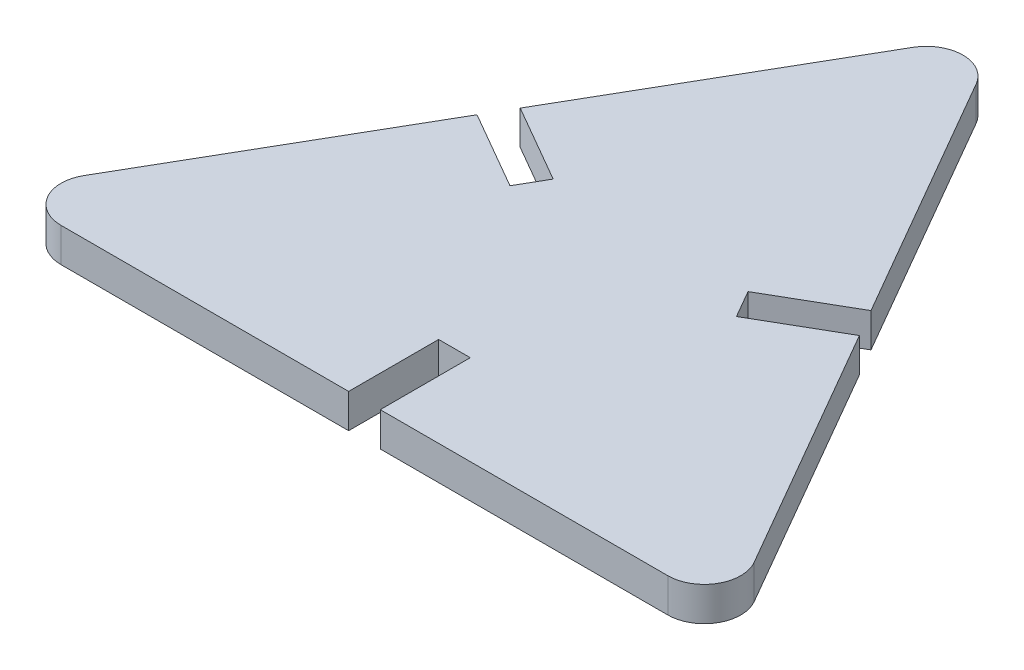
ISO-10303-21;
HEADER;
FILE_DESCRIPTION(('STEP AP214'),'2;1');
FILE_NAME('part.step','',(''),(''),'','','');
FILE_SCHEMA(('AUTOMOTIVE_DESIGN { 1 0 10303 214 1 1 1 1 }'));
ENDSEC;
DATA;
#1=APPLICATION_CONTEXT('core data for automotive mechanical design processes');
#2=APPLICATION_PROTOCOL_DEFINITION('international standard','automotive_design',2000,#1);
#3=PRODUCT_CONTEXT('',#1,'mechanical');
#4=PRODUCT('Part','Part','',(#3));
#5=PRODUCT_RELATED_PRODUCT_CATEGORY('part','',(#4));
#6=PRODUCT_DEFINITION_FORMATION('','',#4);
#7=PRODUCT_DEFINITION_CONTEXT('part definition',#1,'design');
#8=PRODUCT_DEFINITION('design','',#6,#7);
#9=PRODUCT_DEFINITION_SHAPE('','',#8);
#10=(LENGTH_UNIT() NAMED_UNIT(*) SI_UNIT(.MILLI.,.METRE.));
#11=(NAMED_UNIT(*) PLANE_ANGLE_UNIT() SI_UNIT($,.RADIAN.));
#12=(NAMED_UNIT(*) SI_UNIT($,.STERADIAN.) SOLID_ANGLE_UNIT());
#13=UNCERTAINTY_MEASURE_WITH_UNIT(LENGTH_MEASURE(1.E-05),#10,'distance_accuracy_value','');
#14=(GEOMETRIC_REPRESENTATION_CONTEXT(3) GLOBAL_UNCERTAINTY_ASSIGNED_CONTEXT((#13)) GLOBAL_UNIT_ASSIGNED_CONTEXT((#10,
#11,#12)) REPRESENTATION_CONTEXT('',''));
#15=CARTESIAN_POINT('',(0.,0.,0.));
#16=DIRECTION('',(0.,0.,1.));
#17=DIRECTION('',(1.,0.,0.));
#18=AXIS2_PLACEMENT_3D('',#15,#16,#17);
#19=CARTESIAN_POINT('',(-1.3,2.8,17.4));
#20=DIRECTION('',(-1.,0.,0.));
#21=DIRECTION('',(0.,0.,1.));
#22=AXIS2_PLACEMENT_3D('',#19,#20,#21);
#23=PLANE('',#22);
#24=DIRECTION('',(0.,0.,-1.));
#25=VECTOR('',#24,1.);
#26=CARTESIAN_POINT('',(-1.3,0.,17.4));
#27=LINE('',#26,#25);
#28=CARTESIAN_POINT('',(-1.3,0.,17.4));
#29=VERTEX_POINT('',#28);
#30=CARTESIAN_POINT('',(-1.3,0.,10.));
#31=VERTEX_POINT('',#30);
#32=EDGE_CURVE('E188',#29,#31,#27,.T.);
#33=ORIENTED_EDGE('',*,*,#32,.T.);
#34=DIRECTION('',(0.,-1.,0.));
#35=VECTOR('',#34,1.);
#36=CARTESIAN_POINT('',(-1.3,2.8,10.));
#37=LINE('',#36,#35);
#38=CARTESIAN_POINT('',(-1.3,2.8,10.));
#39=VERTEX_POINT('',#38);
#40=EDGE_CURVE('E11',#39,#31,#37,.T.);
#41=ORIENTED_EDGE('',*,*,#40,.F.);
#42=DIRECTION('',(0.,0.,-1.));
#43=VECTOR('',#42,1.);
#44=CARTESIAN_POINT('',(-1.3,2.8,17.4));
#45=LINE('',#44,#43);
#46=CARTESIAN_POINT('',(-1.3,2.8,17.4));
#47=VERTEX_POINT('',#46);
#48=EDGE_CURVE('E222',#47,#39,#45,.T.);
#49=ORIENTED_EDGE('',*,*,#48,.F.);
#50=DIRECTION('',(0.,-1.,0.));
#51=VECTOR('',#50,1.);
#52=CARTESIAN_POINT('',(-1.3,2.8,17.4));
#53=LINE('',#52,#51);
#54=EDGE_CURVE('E184',#47,#29,#53,.T.);
#55=ORIENTED_EDGE('',*,*,#54,.T.);
#56=EDGE_LOOP('',(#33,#41,#49,#55));
#57=FACE_BOUND('',#56,.T.);
#58=ADVANCED_FACE('F32',(#57),#23,.F.);
#59=CARTESIAN_POINT('',(-1.3,2.8,10.));
#60=DIRECTION('',(0.,0.,-1.));
#61=DIRECTION('',(-1.,0.,0.));
#62=AXIS2_PLACEMENT_3D('',#59,#60,#61);
#63=PLANE('',#62);
#64=DIRECTION('',(1.,0.,0.));
#65=VECTOR('',#64,1.);
#66=CARTESIAN_POINT('',(-1.3,0.,10.));
#67=LINE('',#66,#65);
#68=CARTESIAN_POINT('',(1.3,0.,10.));
#69=VERTEX_POINT('',#68);
#70=EDGE_CURVE('E191',#31,#69,#67,.T.);
#71=ORIENTED_EDGE('',*,*,#70,.T.);
#72=DIRECTION('',(0.,-1.,0.));
#73=VECTOR('',#72,1.);
#74=CARTESIAN_POINT('',(1.3,2.8,10.));
#75=LINE('',#74,#73);
#76=CARTESIAN_POINT('',(1.3,2.8,10.));
#77=VERTEX_POINT('',#76);
#78=EDGE_CURVE('E40',#77,#69,#75,.T.);
#79=ORIENTED_EDGE('',*,*,#78,.F.);
#80=DIRECTION('',(1.,0.,0.));
#81=VECTOR('',#80,1.);
#82=CARTESIAN_POINT('',(-1.3,2.8,10.));
#83=LINE('',#82,#81);
#84=EDGE_CURVE('E121',#39,#77,#83,.T.);
#85=ORIENTED_EDGE('',*,*,#84,.F.);
#86=ORIENTED_EDGE('',*,*,#40,.T.);
#87=EDGE_LOOP('',(#71,#79,#85,#86));
#88=FACE_BOUND('',#87,.T.);
#89=ADVANCED_FACE('F330',(#88),#63,.F.);
#90=CARTESIAN_POINT('',(1.3,2.8,17.4));
#91=DIRECTION('',(1.,0.,0.));
#92=DIRECTION('',(0.,0.,-1.));
#93=AXIS2_PLACEMENT_3D('',#90,#91,#92);
#94=PLANE('',#93);
#95=DIRECTION('',(0.,0.,1.));
#96=VECTOR('',#95,1.);
#97=CARTESIAN_POINT('',(1.3,0.,17.4));
#98=LINE('',#97,#96);
#99=CARTESIAN_POINT('',(1.3,0.,17.4));
#100=VERTEX_POINT('',#99);
#101=EDGE_CURVE('E193',#69,#100,#98,.T.);
#102=ORIENTED_EDGE('',*,*,#101,.T.);
#103=DIRECTION('',(0.,-1.,0.));
#104=VECTOR('',#103,1.);
#105=CARTESIAN_POINT('',(1.3,2.8,17.4));
#106=LINE('',#105,#104);
#107=CARTESIAN_POINT('',(1.3,2.8,17.4));
#108=VERTEX_POINT('',#107);
#109=EDGE_CURVE('E259',#108,#100,#106,.T.);
#110=ORIENTED_EDGE('',*,*,#109,.F.);
#111=DIRECTION('',(0.,0.,1.));
#112=VECTOR('',#111,1.);
#113=CARTESIAN_POINT('',(1.3,2.8,17.4));
#114=LINE('',#113,#112);
#115=EDGE_CURVE('E267',#77,#108,#114,.T.);
#116=ORIENTED_EDGE('',*,*,#115,.F.);
#117=ORIENTED_EDGE('',*,*,#78,.T.);
#118=EDGE_LOOP('',(#102,#110,#116,#117));
#119=FACE_BOUND('',#118,.T.);
#120=ADVANCED_FACE('F265',(#119),#94,.F.);
#121=CARTESIAN_POINT('',(1.3,2.8,17.4));
#122=DIRECTION('',(0.,0.,-1.));
#123=DIRECTION('',(-1.,0.,0.));
#124=AXIS2_PLACEMENT_3D('',#121,#122,#123);
#125=PLANE('',#124);
#126=DIRECTION('',(1.,0.,0.));
#127=VECTOR('',#126,1.);
#128=CARTESIAN_POINT('',(1.3,0.,17.4));
#129=LINE('',#128,#127);
#130=CARTESIAN_POINT('',(24.9415316289919,0.,17.4));
#131=VERTEX_POINT('',#130);
#132=EDGE_CURVE('E195',#100,#131,#129,.T.);
#133=ORIENTED_EDGE('',*,*,#132,.T.);
#134=DIRECTION('',(0.,-1.,0.));
#135=VECTOR('',#134,1.);
#136=CARTESIAN_POINT('',(24.9415316289919,2.8,17.4));
#137=LINE('',#136,#135);
#138=CARTESIAN_POINT('',(24.9415316289919,2.8,17.4));
#139=VERTEX_POINT('',#138);
#140=EDGE_CURVE('E256',#139,#131,#137,.T.);
#141=ORIENTED_EDGE('',*,*,#140,.F.);
#142=DIRECTION('',(1.,0.,0.));
#143=VECTOR('',#142,1.);
#144=CARTESIAN_POINT('',(1.3,2.8,17.4));
#145=LINE('',#144,#143);
#146=EDGE_CURVE('E285',#108,#139,#145,.T.);
#147=ORIENTED_EDGE('',*,*,#146,.F.);
#148=ORIENTED_EDGE('',*,*,#109,.T.);
#149=EDGE_LOOP('',(#133,#141,#147,#148));
#150=FACE_BOUND('',#149,.T.);
#151=ADVANCED_FACE('F276',(#150),#125,.F.);
#152=CARTESIAN_POINT('',(24.9415316289919,2.8,14.4));
#153=DIRECTION('',(0.,-1.,0.));
#154=DIRECTION('',(0.,0.,-1.));
#155=AXIS2_PLACEMENT_3D('',#152,#153,#154);
#156=CYLINDRICAL_SURFACE('',#155,3.);
#157=CARTESIAN_POINT('',(24.9415316289919,0.,14.4));
#158=DIRECTION('',(0.,1.,0.));
#159=DIRECTION('',(0.,0.,1.));
#160=AXIS2_PLACEMENT_3D('',#157,#158,#159);
#161=CIRCLE('',#160,3.);
#162=CARTESIAN_POINT('',(27.5396078403452,0.,12.9));
#163=VERTEX_POINT('',#162);
#164=EDGE_CURVE('E197',#131,#163,#161,.T.);
#165=ORIENTED_EDGE('',*,*,#164,.T.);
#166=DIRECTION('',(0.,-1.,0.));
#167=VECTOR('',#166,1.);
#168=CARTESIAN_POINT('',(27.5396078403452,2.8,12.9));
#169=LINE('',#168,#167);
#170=CARTESIAN_POINT('',(27.5396078403452,2.8,12.9));
#171=VERTEX_POINT('',#170);
#172=EDGE_CURVE('E253',#171,#163,#169,.T.);
#173=ORIENTED_EDGE('',*,*,#172,.F.);
#174=CARTESIAN_POINT('',(24.9415316289919,2.8,14.4));
#175=DIRECTION('',(0.,1.,0.));
#176=DIRECTION('',(0.,0.,1.));
#177=AXIS2_PLACEMENT_3D('',#174,#175,#176);
#178=CIRCLE('',#177,3.);
#179=EDGE_CURVE('E282',#139,#171,#178,.T.);
#180=ORIENTED_EDGE('',*,*,#179,.F.);
#181=ORIENTED_EDGE('',*,*,#140,.T.);
#182=EDGE_LOOP('',(#165,#173,#180,#181));
#183=FACE_BOUND('',#182,.T.);
#184=ADVANCED_FACE('F280',(#183),#156,.T.);
#185=CARTESIAN_POINT('',(27.5396078403452,2.8,12.9));
#186=DIRECTION('',(-0.866025403784439,0.,0.5));
#187=DIRECTION('',(0.5,0.,0.866025403784439));
#188=AXIS2_PLACEMENT_3D('',#185,#186,#187);
#189=PLANE('',#188);
#190=DIRECTION('',(-0.5,0.,-0.866025403784439));
#191=VECTOR('',#190,1.);
#192=CARTESIAN_POINT('',(27.5396078403452,0.,12.9));
#193=LINE('',#192,#191);
#194=CARTESIAN_POINT('',(15.7188420258493,0.,-7.57416697508027));
#195=VERTEX_POINT('',#194);
#196=EDGE_CURVE('E199',#163,#195,#193,.T.);
#197=ORIENTED_EDGE('',*,*,#196,.T.);
#198=DIRECTION('',(0.,-1.,0.));
#199=VECTOR('',#198,1.);
#200=CARTESIAN_POINT('',(15.7188420258493,2.8,-7.57416697508027));
#201=LINE('',#200,#199);
#202=CARTESIAN_POINT('',(15.7188420258493,2.8,-7.57416697508027));
#203=VERTEX_POINT('',#202);
#204=EDGE_CURVE('E250',#203,#195,#201,.T.);
#205=ORIENTED_EDGE('',*,*,#204,.F.);
#206=DIRECTION('',(-0.5,0.,-0.866025403784439));
#207=VECTOR('',#206,1.);
#208=CARTESIAN_POINT('',(27.5396078403452,2.8,12.9));
#209=LINE('',#208,#207);
#210=EDGE_CURVE('E284',#171,#203,#209,.T.);
#211=ORIENTED_EDGE('',*,*,#210,.F.);
#212=ORIENTED_EDGE('',*,*,#172,.T.);
#213=EDGE_LOOP('',(#197,#205,#211,#212));
#214=FACE_BOUND('',#213,.T.);
#215=ADVANCED_FACE('F343',(#214),#189,.F.);
#216=CARTESIAN_POINT('',(15.7188420258493,2.8,-7.57416697508027));
#217=DIRECTION('',(0.5,0.,0.866025403784438));
#218=DIRECTION('',(0.866025403784438,0.,-0.5));
#219=AXIS2_PLACEMENT_3D('',#216,#217,#218);
#220=PLANE('',#219);
#221=DIRECTION('',(-0.866025403784438,0.,0.5));
#222=VECTOR('',#221,1.);
#223=CARTESIAN_POINT('',(15.7188420258493,0.,-7.57416697508027));
#224=LINE('',#223,#222);
#225=CARTESIAN_POINT('',(9.31025403784441,0.,-3.87416697508027));
#226=VERTEX_POINT('',#225);
#227=EDGE_CURVE('E201',#195,#226,#224,.T.);
#228=ORIENTED_EDGE('',*,*,#227,.T.);
#229=DIRECTION('',(0.,-1.,0.));
#230=VECTOR('',#229,1.);
#231=CARTESIAN_POINT('',(9.31025403784441,2.8,-3.87416697508027));
#232=LINE('',#231,#230);
#233=CARTESIAN_POINT('',(9.31025403784441,2.8,-3.87416697508027));
#234=VERTEX_POINT('',#233);
#235=EDGE_CURVE('E247',#234,#226,#232,.T.);
#236=ORIENTED_EDGE('',*,*,#235,.F.);
#237=DIRECTION('',(-0.866025403784438,0.,0.5));
#238=VECTOR('',#237,1.);
#239=CARTESIAN_POINT('',(15.7188420258493,2.8,-7.57416697508027));
#240=LINE('',#239,#238);
#241=EDGE_CURVE('E287',#203,#234,#240,.T.);
#242=ORIENTED_EDGE('',*,*,#241,.F.);
#243=ORIENTED_EDGE('',*,*,#204,.T.);
#244=EDGE_LOOP('',(#228,#236,#242,#243));
#245=FACE_BOUND('',#244,.T.);
#246=ADVANCED_FACE('F346',(#245),#220,.F.);
#247=CARTESIAN_POINT('',(9.31025403784441,2.8,-3.87416697508027));
#248=DIRECTION('',(-0.866025403784438,0.,0.5));
#249=DIRECTION('',(0.5,0.,0.866025403784439));
#250=AXIS2_PLACEMENT_3D('',#247,#248,#249);
#251=PLANE('',#250);
#252=DIRECTION('',(-0.5,0.,-0.866025403784438));
#253=VECTOR('',#252,1.);
#254=CARTESIAN_POINT('',(9.31025403784441,0.,-3.87416697508027));
#255=LINE('',#254,#253);
#256=CARTESIAN_POINT('',(8.01025403784441,0.,-6.12583302491981));
#257=VERTEX_POINT('',#256);
#258=EDGE_CURVE('E203',#226,#257,#255,.T.);
#259=ORIENTED_EDGE('',*,*,#258,.T.);
#260=DIRECTION('',(0.,-1.,0.));
#261=VECTOR('',#260,1.);
#262=CARTESIAN_POINT('',(8.01025403784441,2.8,-6.12583302491981));
#263=LINE('',#262,#261);
#264=CARTESIAN_POINT('',(8.01025403784441,2.8,-6.12583302491981));
#265=VERTEX_POINT('',#264);
#266=EDGE_CURVE('E244',#265,#257,#263,.T.);
#267=ORIENTED_EDGE('',*,*,#266,.F.);
#268=DIRECTION('',(-0.5,0.,-0.866025403784438));
#269=VECTOR('',#268,1.);
#270=CARTESIAN_POINT('',(9.31025403784441,2.8,-3.87416697508027));
#271=LINE('',#270,#269);
#272=EDGE_CURVE('E293',#234,#265,#271,.T.);
#273=ORIENTED_EDGE('',*,*,#272,.F.);
#274=ORIENTED_EDGE('',*,*,#235,.T.);
#275=EDGE_LOOP('',(#259,#267,#273,#274));
#276=FACE_BOUND('',#275,.T.);
#277=ADVANCED_FACE('F350',(#276),#251,.F.);
#278=CARTESIAN_POINT('',(14.4188420258492,2.8,-9.82583302491981));
#279=DIRECTION('',(-0.5,0.,-0.866025403784438));
#280=DIRECTION('',(-0.866025403784438,0.,0.5));
#281=AXIS2_PLACEMENT_3D('',#278,#279,#280);
#282=PLANE('',#281);
#283=DIRECTION('',(0.866025403784438,0.,-0.5));
#284=VECTOR('',#283,1.);
#285=CARTESIAN_POINT('',(14.4188420258492,0.,-9.82583302491981));
#286=LINE('',#285,#284);
#287=CARTESIAN_POINT('',(14.4188420258492,0.,-9.82583302491981));
#288=VERTEX_POINT('',#287);
#289=EDGE_CURVE('E205',#257,#288,#286,.T.);
#290=ORIENTED_EDGE('',*,*,#289,.T.);
#291=DIRECTION('',(0.,-1.,0.));
#292=VECTOR('',#291,1.);
#293=CARTESIAN_POINT('',(14.4188420258492,2.8,-9.82583302491981));
#294=LINE('',#293,#292);
#295=CARTESIAN_POINT('',(14.4188420258492,2.8,-9.82583302491981));
#296=VERTEX_POINT('',#295);
#297=EDGE_CURVE('E241',#296,#288,#294,.T.);
#298=ORIENTED_EDGE('',*,*,#297,.F.);
#299=DIRECTION('',(0.866025403784438,0.,-0.5));
#300=VECTOR('',#299,1.);
#301=CARTESIAN_POINT('',(14.4188420258492,2.8,-9.82583302491981));
#302=LINE('',#301,#300);
#303=EDGE_CURVE('E295',#265,#296,#302,.T.);
#304=ORIENTED_EDGE('',*,*,#303,.F.);
#305=ORIENTED_EDGE('',*,*,#266,.T.);
#306=EDGE_LOOP('',(#290,#298,#304,#305));
#307=FACE_BOUND('',#306,.T.);
#308=ADVANCED_FACE('F354',(#307),#282,.F.);
#309=CARTESIAN_POINT('',(14.4188420258492,2.8,-9.82583302491981));
#310=DIRECTION('',(-0.866025403784438,0.,0.500000000000001));
#311=DIRECTION('',(0.500000000000001,0.,0.866025403784438));
#312=AXIS2_PLACEMENT_3D('',#309,#310,#311);
#313=PLANE('',#312);
#314=DIRECTION('',(-0.500000000000001,0.,-0.866025403784438));
#315=VECTOR('',#314,1.);
#316=CARTESIAN_POINT('',(14.4188420258492,0.,-9.82583302491981));
#317=LINE('',#316,#315);
#318=CARTESIAN_POINT('',(2.59807621135331,0.,-30.3));
#319=VERTEX_POINT('',#318);
#320=EDGE_CURVE('E207',#288,#319,#317,.T.);
#321=ORIENTED_EDGE('',*,*,#320,.T.);
#322=DIRECTION('',(0.,-1.,0.));
#323=VECTOR('',#322,1.);
#324=CARTESIAN_POINT('',(2.59807621135331,2.8,-30.3));
#325=LINE('',#324,#323);
#326=CARTESIAN_POINT('',(2.59807621135331,2.8,-30.3));
#327=VERTEX_POINT('',#326);
#328=EDGE_CURVE('E238',#327,#319,#325,.T.);
#329=ORIENTED_EDGE('',*,*,#328,.F.);
#330=DIRECTION('',(-0.500000000000001,0.,-0.866025403784438));
#331=VECTOR('',#330,1.);
#332=CARTESIAN_POINT('',(14.4188420258492,2.8,-9.82583302491981));
#333=LINE('',#332,#331);
#334=EDGE_CURVE('E297',#296,#327,#333,.T.);
#335=ORIENTED_EDGE('',*,*,#334,.F.);
#336=ORIENTED_EDGE('',*,*,#297,.T.);
#337=EDGE_LOOP('',(#321,#329,#335,#336));
#338=FACE_BOUND('',#337,.T.);
#339=ADVANCED_FACE('F358',(#338),#313,.F.);
#340=CARTESIAN_POINT('',(0.,2.8,-28.8));
#341=DIRECTION('',(0.,-1.,0.));
#342=DIRECTION('',(0.,0.,-1.));
#343=AXIS2_PLACEMENT_3D('',#340,#341,#342);
#344=CYLINDRICAL_SURFACE('',#343,3.);
#345=CARTESIAN_POINT('',(0.,0.,-28.8));
#346=DIRECTION('',(0.,1.,0.));
#347=DIRECTION('',(0.,0.,1.));
#348=AXIS2_PLACEMENT_3D('',#345,#346,#347);
#349=CIRCLE('',#348,3.);
#350=CARTESIAN_POINT('',(-2.59807621135332,0.,-30.3));
#351=VERTEX_POINT('',#350);
#352=EDGE_CURVE('E209',#319,#351,#349,.T.);
#353=ORIENTED_EDGE('',*,*,#352,.T.);
#354=DIRECTION('',(0.,-1.,0.));
#355=VECTOR('',#354,1.);
#356=CARTESIAN_POINT('',(-2.59807621135332,2.8,-30.3));
#357=LINE('',#356,#355);
#358=CARTESIAN_POINT('',(-2.59807621135332,2.8,-30.3));
#359=VERTEX_POINT('',#358);
#360=EDGE_CURVE('E235',#359,#351,#357,.T.);
#361=ORIENTED_EDGE('',*,*,#360,.F.);
#362=CARTESIAN_POINT('',(0.,2.8,-28.8));
#363=DIRECTION('',(0.,1.,0.));
#364=DIRECTION('',(0.,0.,1.));
#365=AXIS2_PLACEMENT_3D('',#362,#363,#364);
#366=CIRCLE('',#365,3.);
#367=EDGE_CURVE('E299',#327,#359,#366,.T.);
#368=ORIENTED_EDGE('',*,*,#367,.F.);
#369=ORIENTED_EDGE('',*,*,#328,.T.);
#370=EDGE_LOOP('',(#353,#361,#368,#369));
#371=FACE_BOUND('',#370,.T.);
#372=ADVANCED_FACE('F362',(#371),#344,.T.);
#373=CARTESIAN_POINT('',(-2.59807621135332,2.8,-30.3));
#374=DIRECTION('',(0.866025403784438,0.,0.5));
#375=DIRECTION('',(0.5,0.,-0.866025403784438));
#376=AXIS2_PLACEMENT_3D('',#373,#374,#375);
#377=PLANE('',#376);
#378=DIRECTION('',(-0.5,0.,0.866025403784438));
#379=VECTOR('',#378,1.);
#380=CARTESIAN_POINT('',(-2.59807621135332,0.,-30.3));
#381=LINE('',#380,#379);
#382=CARTESIAN_POINT('',(-14.4188420258493,0.,-9.8258330249198));
#383=VERTEX_POINT('',#382);
#384=EDGE_CURVE('E211',#351,#383,#381,.T.);
#385=ORIENTED_EDGE('',*,*,#384,.T.);
#386=DIRECTION('',(0.,-1.,0.));
#387=VECTOR('',#386,1.);
#388=CARTESIAN_POINT('',(-14.4188420258493,2.8,-9.8258330249198));
#389=LINE('',#388,#387);
#390=CARTESIAN_POINT('',(-14.4188420258493,2.8,-9.8258330249198));
#391=VERTEX_POINT('',#390);
#392=EDGE_CURVE('E232',#391,#383,#389,.T.);
#393=ORIENTED_EDGE('',*,*,#392,.F.);
#394=DIRECTION('',(-0.5,0.,0.866025403784438));
#395=VECTOR('',#394,1.);
#396=CARTESIAN_POINT('',(-2.59807621135332,2.8,-30.3));
#397=LINE('',#396,#395);
#398=EDGE_CURVE('E301',#359,#391,#397,.T.);
#399=ORIENTED_EDGE('',*,*,#398,.F.);
#400=ORIENTED_EDGE('',*,*,#360,.T.);
#401=EDGE_LOOP('',(#385,#393,#399,#400));
#402=FACE_BOUND('',#401,.T.);
#403=ADVANCED_FACE('F366',(#402),#377,.F.);
#404=CARTESIAN_POINT('',(-14.4188420258493,2.8,-9.8258330249198));
#405=DIRECTION('',(0.5,0.,-0.866025403784439));
#406=DIRECTION('',(-0.866025403784439,0.,-0.5));
#407=AXIS2_PLACEMENT_3D('',#404,#405,#406);
#408=PLANE('',#407);
#409=DIRECTION('',(0.866025403784439,0.,0.5));
#410=VECTOR('',#409,1.);
#411=CARTESIAN_POINT('',(-14.4188420258493,0.,-9.8258330249198));
#412=LINE('',#411,#410);
#413=CARTESIAN_POINT('',(-8.01025403784441,0.,-6.12583302491981));
#414=VERTEX_POINT('',#413);
#415=EDGE_CURVE('E213',#383,#414,#412,.T.);
#416=ORIENTED_EDGE('',*,*,#415,.T.);
#417=DIRECTION('',(0.,-1.,0.));
#418=VECTOR('',#417,1.);
#419=CARTESIAN_POINT('',(-8.01025403784441,2.8,-6.12583302491981));
#420=LINE('',#419,#418);
#421=CARTESIAN_POINT('',(-8.01025403784441,2.8,-6.12583302491981));
#422=VERTEX_POINT('',#421);
#423=EDGE_CURVE('E229',#422,#414,#420,.T.);
#424=ORIENTED_EDGE('',*,*,#423,.F.);
#425=DIRECTION('',(0.866025403784439,0.,0.5));
#426=VECTOR('',#425,1.);
#427=CARTESIAN_POINT('',(-14.4188420258493,2.8,-9.8258330249198));
#428=LINE('',#427,#426);
#429=EDGE_CURVE('E303',#391,#422,#428,.T.);
#430=ORIENTED_EDGE('',*,*,#429,.F.);
#431=ORIENTED_EDGE('',*,*,#392,.T.);
#432=EDGE_LOOP('',(#416,#424,#430,#431));
#433=FACE_BOUND('',#432,.T.);
#434=ADVANCED_FACE('F370',(#433),#408,.F.);
#435=CARTESIAN_POINT('',(-8.01025403784441,2.8,-6.12583302491981));
#436=DIRECTION('',(0.866025403784439,0.,0.5));
#437=DIRECTION('',(0.5,0.,-0.866025403784439));
#438=AXIS2_PLACEMENT_3D('',#435,#436,#437);
#439=PLANE('',#438);
#440=DIRECTION('',(-0.5,0.,0.866025403784439));
#441=VECTOR('',#440,1.);
#442=CARTESIAN_POINT('',(-8.01025403784441,0.,-6.12583302491981));
#443=LINE('',#442,#441);
#444=CARTESIAN_POINT('',(-9.31025403784441,0.,-3.87416697508027));
#445=VERTEX_POINT('',#444);
#446=EDGE_CURVE('E215',#414,#445,#443,.T.);
#447=ORIENTED_EDGE('',*,*,#446,.T.);
#448=DIRECTION('',(0.,-1.,0.));
#449=VECTOR('',#448,1.);
#450=CARTESIAN_POINT('',(-9.31025403784441,2.8,-3.87416697508027));
#451=LINE('',#450,#449);
#452=CARTESIAN_POINT('',(-9.31025403784441,2.8,-3.87416697508027));
#453=VERTEX_POINT('',#452);
#454=EDGE_CURVE('E226',#453,#445,#451,.T.);
#455=ORIENTED_EDGE('',*,*,#454,.F.);
#456=DIRECTION('',(-0.5,0.,0.866025403784439));
#457=VECTOR('',#456,1.);
#458=CARTESIAN_POINT('',(-8.01025403784441,2.8,-6.12583302491981));
#459=LINE('',#458,#457);
#460=EDGE_CURVE('E305',#422,#453,#459,.T.);
#461=ORIENTED_EDGE('',*,*,#460,.F.);
#462=ORIENTED_EDGE('',*,*,#423,.T.);
#463=EDGE_LOOP('',(#447,#455,#461,#462));
#464=FACE_BOUND('',#463,.T.);
#465=ADVANCED_FACE('F311',(#464),#439,.F.);
#466=CARTESIAN_POINT('',(-15.7188420258493,2.8,-7.57416697508026));
#467=DIRECTION('',(-0.5,0.,0.866025403784439));
#468=DIRECTION('',(0.866025403784439,0.,0.5));
#469=AXIS2_PLACEMENT_3D('',#466,#467,#468);
#470=PLANE('',#469);
#471=DIRECTION('',(-0.866025403784439,0.,-0.5));
#472=VECTOR('',#471,1.);
#473=CARTESIAN_POINT('',(-15.7188420258493,0.,-7.57416697508026));
#474=LINE('',#473,#472);
#475=CARTESIAN_POINT('',(-15.7188420258493,0.,-7.57416697508026));
#476=VERTEX_POINT('',#475);
#477=EDGE_CURVE('E217',#445,#476,#474,.T.);
#478=ORIENTED_EDGE('',*,*,#477,.T.);
#479=DIRECTION('',(0.,-1.,0.));
#480=VECTOR('',#479,1.);
#481=CARTESIAN_POINT('',(-15.7188420258493,2.8,-7.57416697508026));
#482=LINE('',#481,#480);
#483=CARTESIAN_POINT('',(-15.7188420258493,2.8,-7.57416697508026));
#484=VERTEX_POINT('',#483);
#485=EDGE_CURVE('E179',#484,#476,#482,.T.);
#486=ORIENTED_EDGE('',*,*,#485,.F.);
#487=DIRECTION('',(-0.866025403784439,0.,-0.5));
#488=VECTOR('',#487,1.);
#489=CARTESIAN_POINT('',(-15.7188420258493,2.8,-7.57416697508026));
#490=LINE('',#489,#488);
#491=EDGE_CURVE('E170',#453,#484,#490,.T.);
#492=ORIENTED_EDGE('',*,*,#491,.F.);
#493=ORIENTED_EDGE('',*,*,#454,.T.);
#494=EDGE_LOOP('',(#478,#486,#492,#493));
#495=FACE_BOUND('',#494,.T.);
#496=ADVANCED_FACE('F315',(#495),#470,.F.);
#497=CARTESIAN_POINT('',(-15.7188420258493,2.8,-7.57416697508026));
#498=DIRECTION('',(0.866025403784439,0.,0.5));
#499=DIRECTION('',(0.5,0.,-0.866025403784439));
#500=AXIS2_PLACEMENT_3D('',#497,#498,#499);
#501=PLANE('',#500);
#502=DIRECTION('',(-0.5,0.,0.866025403784439));
#503=VECTOR('',#502,1.);
#504=CARTESIAN_POINT('',(-15.7188420258493,0.,-7.57416697508026));
#505=LINE('',#504,#503);
#506=CARTESIAN_POINT('',(-27.5396078403452,0.,12.9));
#507=VERTEX_POINT('',#506);
#508=EDGE_CURVE('E178',#476,#507,#505,.T.);
#509=ORIENTED_EDGE('',*,*,#508,.T.);
#510=DIRECTION('',(0.,-1.,0.));
#511=VECTOR('',#510,1.);
#512=CARTESIAN_POINT('',(-27.5396078403452,2.8,12.9));
#513=LINE('',#512,#511);
#514=CARTESIAN_POINT('',(-27.5396078403452,2.8,12.9));
#515=VERTEX_POINT('',#514);
#516=EDGE_CURVE('E175',#515,#507,#513,.T.);
#517=ORIENTED_EDGE('',*,*,#516,.F.);
#518=DIRECTION('',(-0.5,0.,0.866025403784439));
#519=VECTOR('',#518,1.);
#520=CARTESIAN_POINT('',(-15.7188420258493,2.8,-7.57416697508026));
#521=LINE('',#520,#519);
#522=EDGE_CURVE('E164',#484,#515,#521,.T.);
#523=ORIENTED_EDGE('',*,*,#522,.F.);
#524=ORIENTED_EDGE('',*,*,#485,.T.);
#525=EDGE_LOOP('',(#509,#517,#523,#524));
#526=FACE_BOUND('',#525,.T.);
#527=ADVANCED_FACE('F176',(#526),#501,.F.);
#528=CARTESIAN_POINT('',(-24.9415316289919,2.8,14.4));
#529=DIRECTION('',(0.,-1.,0.));
#530=DIRECTION('',(0.,0.,-1.));
#531=AXIS2_PLACEMENT_3D('',#528,#529,#530);
#532=CYLINDRICAL_SURFACE('',#531,3.);
#533=CARTESIAN_POINT('',(-24.9415316289919,0.,14.4));
#534=DIRECTION('',(0.,1.,0.));
#535=DIRECTION('',(0.,0.,-1.));
#536=AXIS2_PLACEMENT_3D('',#533,#534,#535);
#537=CIRCLE('',#536,3.);
#538=CARTESIAN_POINT('',(-24.9415316289919,0.,17.4));
#539=VERTEX_POINT('',#538);
#540=EDGE_CURVE('E107',#507,#539,#537,.T.);
#541=ORIENTED_EDGE('',*,*,#540,.T.);
#542=DIRECTION('',(0.,-1.,0.));
#543=VECTOR('',#542,1.);
#544=CARTESIAN_POINT('',(-24.9415316289919,2.8,17.4));
#545=LINE('',#544,#543);
#546=CARTESIAN_POINT('',(-24.9415316289919,2.8,17.4));
#547=VERTEX_POINT('',#546);
#548=EDGE_CURVE('E180',#547,#539,#545,.T.);
#549=ORIENTED_EDGE('',*,*,#548,.F.);
#550=CARTESIAN_POINT('',(-24.9415316289919,2.8,14.4));
#551=DIRECTION('',(0.,1.,0.));
#552=DIRECTION('',(0.,0.,-1.));
#553=AXIS2_PLACEMENT_3D('',#550,#551,#552);
#554=CIRCLE('',#553,3.);
#555=EDGE_CURVE('E168',#515,#547,#554,.T.);
#556=ORIENTED_EDGE('',*,*,#555,.F.);
#557=ORIENTED_EDGE('',*,*,#516,.T.);
#558=EDGE_LOOP('',(#541,#549,#556,#557));
#559=FACE_BOUND('',#558,.T.);
#560=ADVANCED_FACE('F182',(#559),#532,.T.);
#561=CARTESIAN_POINT('',(-24.9415316289919,2.8,17.4));
#562=DIRECTION('',(0.,0.,-1.));
#563=DIRECTION('',(-1.,0.,0.));
#564=AXIS2_PLACEMENT_3D('',#561,#562,#563);
#565=PLANE('',#564);
#566=DIRECTION('',(1.,0.,0.));
#567=VECTOR('',#566,1.);
#568=CARTESIAN_POINT('',(-24.9415316289919,0.,17.4));
#569=LINE('',#568,#567);
#570=EDGE_CURVE('E113',#539,#29,#569,.T.);
#571=ORIENTED_EDGE('',*,*,#570,.T.);
#572=ORIENTED_EDGE('',*,*,#54,.F.);
#573=DIRECTION('',(1.,0.,0.));
#574=VECTOR('',#573,1.);
#575=CARTESIAN_POINT('',(-24.9415316289919,2.8,17.4));
#576=LINE('',#575,#574);
#577=EDGE_CURVE('E48',#547,#47,#576,.T.);
#578=ORIENTED_EDGE('',*,*,#577,.F.);
#579=ORIENTED_EDGE('',*,*,#548,.T.);
#580=EDGE_LOOP('',(#571,#572,#578,#579));
#581=FACE_BOUND('',#580,.T.);
#582=ADVANCED_FACE('F319',(#581),#565,.F.);
#583=CARTESIAN_POINT('',(24.9415316289919,2.8,14.4));
#584=DIRECTION('',(0.,1.,0.));
#585=DIRECTION('',(0.,0.,1.));
#586=AXIS2_PLACEMENT_3D('',#583,#584,#585);
#587=PLANE('',#586);
#588=ORIENTED_EDGE('',*,*,#48,.T.);
#589=ORIENTED_EDGE('',*,*,#84,.T.);
#590=ORIENTED_EDGE('',*,*,#115,.T.);
#591=ORIENTED_EDGE('',*,*,#146,.T.);
#592=ORIENTED_EDGE('',*,*,#179,.T.);
#593=ORIENTED_EDGE('',*,*,#210,.T.);
#594=ORIENTED_EDGE('',*,*,#241,.T.);
#595=ORIENTED_EDGE('',*,*,#272,.T.);
#596=ORIENTED_EDGE('',*,*,#303,.T.);
#597=ORIENTED_EDGE('',*,*,#334,.T.);
#598=ORIENTED_EDGE('',*,*,#367,.T.);
#599=ORIENTED_EDGE('',*,*,#398,.T.);
#600=ORIENTED_EDGE('',*,*,#429,.T.);
#601=ORIENTED_EDGE('',*,*,#460,.T.);
#602=ORIENTED_EDGE('',*,*,#491,.T.);
#603=ORIENTED_EDGE('',*,*,#522,.T.);
#604=ORIENTED_EDGE('',*,*,#555,.T.);
#605=ORIENTED_EDGE('',*,*,#577,.T.);
#606=EDGE_LOOP('',(#588,#589,#590,#591,#592,#593,#594,#595,#596,#597,#598,#599,#600,#601,#602,
#603,#604,#605));
#607=FACE_BOUND('',#606,.T.);
#608=ADVANCED_FACE('F166',(#607),#587,.T.);
#609=CARTESIAN_POINT('',(24.9415316289919,0.,14.4));
#610=DIRECTION('',(0.,1.,0.));
#611=DIRECTION('',(0.,0.,1.));
#612=AXIS2_PLACEMENT_3D('',#609,#610,#611);
#613=PLANE('',#612);
#614=ORIENTED_EDGE('',*,*,#32,.F.);
#615=ORIENTED_EDGE('',*,*,#570,.F.);
#616=ORIENTED_EDGE('',*,*,#540,.F.);
#617=ORIENTED_EDGE('',*,*,#508,.F.);
#618=ORIENTED_EDGE('',*,*,#477,.F.);
#619=ORIENTED_EDGE('',*,*,#446,.F.);
#620=ORIENTED_EDGE('',*,*,#415,.F.);
#621=ORIENTED_EDGE('',*,*,#384,.F.);
#622=ORIENTED_EDGE('',*,*,#352,.F.);
#623=ORIENTED_EDGE('',*,*,#320,.F.);
#624=ORIENTED_EDGE('',*,*,#289,.F.);
#625=ORIENTED_EDGE('',*,*,#258,.F.);
#626=ORIENTED_EDGE('',*,*,#227,.F.);
#627=ORIENTED_EDGE('',*,*,#196,.F.);
#628=ORIENTED_EDGE('',*,*,#164,.F.);
#629=ORIENTED_EDGE('',*,*,#132,.F.);
#630=ORIENTED_EDGE('',*,*,#101,.F.);
#631=ORIENTED_EDGE('',*,*,#70,.F.);
#632=EDGE_LOOP('',(#614,#615,#616,#617,#618,#619,#620,#621,#622,#623,#624,#625,#626,#627,#628,
#629,#630,#631));
#633=FACE_BOUND('',#632,.T.);
#634=ADVANCED_FACE('F271',(#633),#613,.F.);
#635=CLOSED_SHELL('',(#58,#89,#120,#151,#184,#215,#246,#277,#308,#339,#372,#403,#434,#465,#496,
#527,#560,#582,#608,#634));
#636=MANIFOLD_SOLID_BREP('B2',#635);
#637=ADVANCED_BREP_SHAPE_REPRESENTATION('',(#18,#636),#14);
#638=SHAPE_DEFINITION_REPRESENTATION(#9,#637);
ENDSEC;
END-ISO-10303-21;
